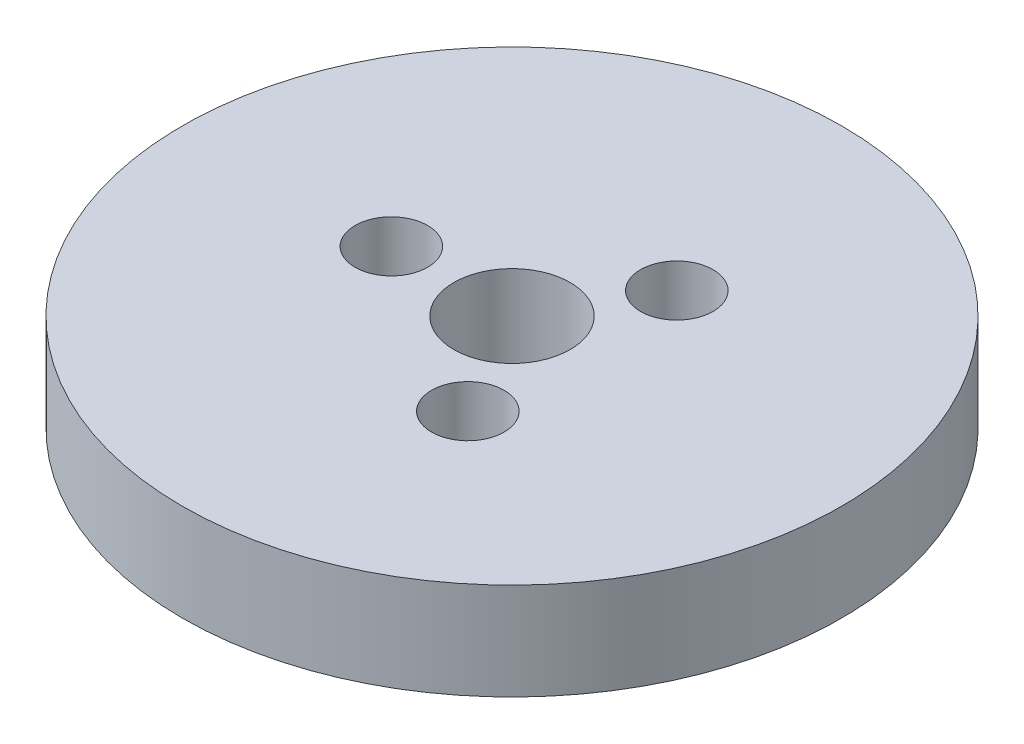
ISO-10303-21;
HEADER;
FILE_DESCRIPTION(('STEP AP214'),'2;1');
FILE_NAME('part.step','',(''),(''),'','','');
FILE_SCHEMA(('AUTOMOTIVE_DESIGN { 1 0 10303 214 1 1 1 1 }'));
ENDSEC;
DATA;
#1=APPLICATION_CONTEXT('core data for automotive mechanical design processes');
#2=APPLICATION_PROTOCOL_DEFINITION('international standard','automotive_design',2000,#1);
#3=PRODUCT_CONTEXT('',#1,'mechanical');
#4=PRODUCT('Part','Part','',(#3));
#5=PRODUCT_RELATED_PRODUCT_CATEGORY('part','',(#4));
#6=PRODUCT_DEFINITION_FORMATION('','',#4);
#7=PRODUCT_DEFINITION_CONTEXT('part definition',#1,'design');
#8=PRODUCT_DEFINITION('design','',#6,#7);
#9=PRODUCT_DEFINITION_SHAPE('','',#8);
#10=(LENGTH_UNIT() NAMED_UNIT(*) SI_UNIT(.MILLI.,.METRE.));
#11=(NAMED_UNIT(*) PLANE_ANGLE_UNIT() SI_UNIT($,.RADIAN.));
#12=(NAMED_UNIT(*) SI_UNIT($,.STERADIAN.) SOLID_ANGLE_UNIT());
#13=UNCERTAINTY_MEASURE_WITH_UNIT(LENGTH_MEASURE(1.E-05),#10,'distance_accuracy_value','');
#14=(GEOMETRIC_REPRESENTATION_CONTEXT(3) GLOBAL_UNCERTAINTY_ASSIGNED_CONTEXT((#13)) GLOBAL_UNIT_ASSIGNED_CONTEXT((#10,
#11,#12)) REPRESENTATION_CONTEXT('',''));
#15=CARTESIAN_POINT('',(0.,0.,0.));
#16=DIRECTION('',(0.,0.,1.));
#17=DIRECTION('',(1.,0.,0.));
#18=AXIS2_PLACEMENT_3D('',#15,#16,#17);
#19=CARTESIAN_POINT('',(0.,25.,0.));
#20=DIRECTION('',(0.,-1.,0.));
#21=DIRECTION('',(0.,0.,-1.));
#22=AXIS2_PLACEMENT_3D('',#19,#20,#21);
#23=CYLINDRICAL_SURFACE('',#22,85.);
#24=CARTESIAN_POINT('',(0.,25.,0.));
#25=DIRECTION('',(0.,1.,0.));
#26=DIRECTION('',(0.,0.,1.));
#27=AXIS2_PLACEMENT_3D('',#24,#25,#26);
#28=CIRCLE('',#27,85.);
#29=CARTESIAN_POINT('',(0.,25.,85.));
#30=VERTEX_POINT('',#29);
#31=EDGE_CURVE('E10',#30,#30,#28,.T.);
#32=ORIENTED_EDGE('',*,*,#31,.F.);
#33=EDGE_LOOP('',(#32));
#34=FACE_BOUND('',#33,.T.);
#35=CARTESIAN_POINT('',(0.,0.,0.));
#36=DIRECTION('',(0.,1.,0.));
#37=DIRECTION('',(0.,0.,1.));
#38=AXIS2_PLACEMENT_3D('',#35,#36,#37);
#39=CIRCLE('',#38,85.);
#40=CARTESIAN_POINT('',(0.,0.,85.));
#41=VERTEX_POINT('',#40);
#42=EDGE_CURVE('E37',#41,#41,#39,.T.);
#43=ORIENTED_EDGE('',*,*,#42,.T.);
#44=EDGE_LOOP('',(#43));
#45=FACE_BOUND('',#44,.T.);
#46=ADVANCED_FACE('F40',(#34,#45),#23,.T.);
#47=CARTESIAN_POINT('',(0.,25.,0.));
#48=DIRECTION('',(0.,1.,0.));
#49=DIRECTION('',(0.,0.,1.));
#50=AXIS2_PLACEMENT_3D('',#47,#48,#49);
#51=PLANE('',#50);
#52=CARTESIAN_POINT('',(15.5590153157143,25.,26.9490050425592));
#53=DIRECTION('',(0.,1.,0.));
#54=DIRECTION('',(0.866025403784436,0.,-0.500000000000004));
#55=AXIS2_PLACEMENT_3D('',#52,#53,#54);
#56=CIRCLE('',#55,9.35262577643471);
#57=CARTESIAN_POINT('',(23.6586268301959,25.,22.2726921543418));
#58=VERTEX_POINT('',#57);
#59=EDGE_CURVE('E70',#58,#58,#56,.T.);
#60=ORIENTED_EDGE('',*,*,#59,.F.);
#61=EDGE_LOOP('',(#60));
#62=FACE_BOUND('',#61,.T.);
#63=CARTESIAN_POINT('',(15.5590153157139,25.,-26.9490050425594));
#64=DIRECTION('',(0.,1.,0.));
#65=DIRECTION('',(-0.866025403784443,0.,-0.499999999999992));
#66=AXIS2_PLACEMENT_3D('',#63,#64,#65);
#67=CIRCLE('',#66,9.35262577643471);
#68=CARTESIAN_POINT('',(7.45940380123228,25.,-31.6253179307767));
#69=VERTEX_POINT('',#68);
#70=EDGE_CURVE('E61',#69,#69,#67,.T.);
#71=ORIENTED_EDGE('',*,*,#70,.F.);
#72=EDGE_LOOP('',(#71));
#73=FACE_BOUND('',#72,.T.);
#74=CARTESIAN_POINT('',(-31.1180306314284,25.,0.));
#75=DIRECTION('',(0.,1.,0.));
#76=DIRECTION('',(0.,0.,1.));
#77=AXIS2_PLACEMENT_3D('',#74,#75,#76);
#78=CIRCLE('',#77,9.35262577643471);
#79=CARTESIAN_POINT('',(-31.1180306314284,25.,9.35262577643471));
#80=VERTEX_POINT('',#79);
#81=EDGE_CURVE('E54',#80,#80,#78,.T.);
#82=ORIENTED_EDGE('',*,*,#81,.F.);
#83=EDGE_LOOP('',(#82));
#84=FACE_BOUND('',#83,.T.);
#85=CARTESIAN_POINT('',(0.,25.,0.));
#86=DIRECTION('',(0.,1.,0.));
#87=DIRECTION('',(0.,0.,1.));
#88=AXIS2_PLACEMENT_3D('',#85,#86,#87);
#89=CIRCLE('',#88,15.);
#90=CARTESIAN_POINT('',(0.,25.,15.));
#91=VERTEX_POINT('',#90);
#92=EDGE_CURVE('E50',#91,#91,#89,.T.);
#93=ORIENTED_EDGE('',*,*,#92,.F.);
#94=EDGE_LOOP('',(#93));
#95=FACE_BOUND('',#94,.T.);
#96=ORIENTED_EDGE('',*,*,#31,.T.);
#97=EDGE_LOOP('',(#96));
#98=FACE_BOUND('',#97,.T.);
#99=ADVANCED_FACE('F85',(#62,#73,#84,#95,#98),#51,.T.);
#100=CARTESIAN_POINT('',(0.,0.,0.));
#101=DIRECTION('',(0.,1.,0.));
#102=DIRECTION('',(0.,0.,1.));
#103=AXIS2_PLACEMENT_3D('',#100,#101,#102);
#104=PLANE('',#103);
#105=CARTESIAN_POINT('',(0.,0.,0.));
#106=DIRECTION('',(0.,1.,0.));
#107=DIRECTION('',(0.,0.,1.));
#108=AXIS2_PLACEMENT_3D('',#105,#106,#107);
#109=CIRCLE('',#108,15.);
#110=CARTESIAN_POINT('',(0.,0.,15.));
#111=VERTEX_POINT('',#110);
#112=EDGE_CURVE('E47',#111,#111,#109,.T.);
#113=ORIENTED_EDGE('',*,*,#112,.T.);
#114=EDGE_LOOP('',(#113));
#115=FACE_BOUND('',#114,.T.);
#116=ORIENTED_EDGE('',*,*,#42,.F.);
#117=EDGE_LOOP('',(#116));
#118=FACE_BOUND('',#117,.T.);
#119=ADVANCED_FACE('F84',(#115,#118),#104,.F.);
#120=CARTESIAN_POINT('',(0.,25.,0.));
#121=DIRECTION('',(0.,-1.,0.));
#122=DIRECTION('',(0.,0.,-1.));
#123=AXIS2_PLACEMENT_3D('',#120,#121,#122);
#124=CYLINDRICAL_SURFACE('',#123,15.);
#125=ORIENTED_EDGE('',*,*,#92,.T.);
#126=EDGE_LOOP('',(#125));
#127=FACE_BOUND('',#126,.T.);
#128=ORIENTED_EDGE('',*,*,#112,.F.);
#129=EDGE_LOOP('',(#128));
#130=FACE_BOUND('',#129,.T.);
#131=ADVANCED_FACE('F91',(#127,#130),#124,.F.);
#132=CARTESIAN_POINT('',(-31.1180306314284,7.42842494550896,0.));
#133=DIRECTION('',(0.,1.,0.));
#134=DIRECTION('',(0.,0.,1.));
#135=AXIS2_PLACEMENT_3D('',#132,#133,#134);
#136=CYLINDRICAL_SURFACE('',#135,9.35262577643471);
#137=CARTESIAN_POINT('',(-31.1180306314284,7.42842494550896,0.));
#138=DIRECTION('',(0.,1.,0.));
#139=DIRECTION('',(0.,0.,1.));
#140=AXIS2_PLACEMENT_3D('',#137,#138,#139);
#141=CIRCLE('',#140,9.35262577643471);
#142=CARTESIAN_POINT('',(-31.1180306314284,7.42842494550896,9.35262577643471));
#143=VERTEX_POINT('',#142);
#144=EDGE_CURVE('E55',#143,#143,#141,.T.);
#145=ORIENTED_EDGE('',*,*,#144,.F.);
#146=EDGE_LOOP('',(#145));
#147=FACE_BOUND('',#146,.T.);
#148=ORIENTED_EDGE('',*,*,#81,.T.);
#149=EDGE_LOOP('',(#148));
#150=FACE_BOUND('',#149,.T.);
#151=ADVANCED_FACE('F96',(#147,#150),#136,.F.);
#152=CARTESIAN_POINT('',(-31.1180306314284,7.42842494550896,0.));
#153=DIRECTION('',(0.,1.,0.));
#154=DIRECTION('',(0.,0.,1.));
#155=AXIS2_PLACEMENT_3D('',#152,#153,#154);
#156=PLANE('',#155);
#157=ORIENTED_EDGE('',*,*,#144,.T.);
#158=EDGE_LOOP('',(#157));
#159=FACE_BOUND('',#158,.T.);
#160=ADVANCED_FACE('F127',(#159),#156,.T.);
#161=CARTESIAN_POINT('',(15.5590153157139,7.42842494550896,-26.9490050425594));
#162=DIRECTION('',(0.,1.,0.));
#163=DIRECTION('',(0.,0.,1.));
#164=AXIS2_PLACEMENT_3D('',#161,#162,#163);
#165=CYLINDRICAL_SURFACE('',#164,9.35262577643471);
#166=CARTESIAN_POINT('',(15.5590153157139,7.42842494550896,-26.9490050425594));
#167=DIRECTION('',(0.,1.,0.));
#168=DIRECTION('',(-0.866025403784443,0.,-0.499999999999992));
#169=AXIS2_PLACEMENT_3D('',#166,#167,#168);
#170=CIRCLE('',#169,9.35262577643471);
#171=CARTESIAN_POINT('',(7.45940380123228,7.42842494550896,-31.6253179307767));
#172=VERTEX_POINT('',#171);
#173=EDGE_CURVE('E63',#172,#172,#170,.T.);
#174=ORIENTED_EDGE('',*,*,#173,.F.);
#175=EDGE_LOOP('',(#174));
#176=FACE_BOUND('',#175,.T.);
#177=ORIENTED_EDGE('',*,*,#70,.T.);
#178=EDGE_LOOP('',(#177));
#179=FACE_BOUND('',#178,.T.);
#180=ADVANCED_FACE('F133',(#176,#179),#165,.F.);
#181=CARTESIAN_POINT('',(15.5590153157139,7.42842494550896,-26.9490050425594));
#182=DIRECTION('',(0.,1.,0.));
#183=DIRECTION('',(-0.866025403784443,0.,-0.499999999999992));
#184=AXIS2_PLACEMENT_3D('',#181,#182,#183);
#185=PLANE('',#184);
#186=ORIENTED_EDGE('',*,*,#173,.T.);
#187=EDGE_LOOP('',(#186));
#188=FACE_BOUND('',#187,.T.);
#189=ADVANCED_FACE('F77',(#188),#185,.T.);
#190=CARTESIAN_POINT('',(15.5590153157143,7.42842494550896,26.9490050425592));
#191=DIRECTION('',(0.,1.,0.));
#192=DIRECTION('',(0.,0.,1.));
#193=AXIS2_PLACEMENT_3D('',#190,#191,#192);
#194=CYLINDRICAL_SURFACE('',#193,9.35262577643471);
#195=CARTESIAN_POINT('',(15.5590153157143,7.42842494550896,26.9490050425592));
#196=DIRECTION('',(0.,1.,0.));
#197=DIRECTION('',(0.866025403784436,0.,-0.500000000000004));
#198=AXIS2_PLACEMENT_3D('',#195,#196,#197);
#199=CIRCLE('',#198,9.35262577643471);
#200=CARTESIAN_POINT('',(23.6586268301959,7.42842494550896,22.2726921543418));
#201=VERTEX_POINT('',#200);
#202=EDGE_CURVE('E59',#201,#201,#199,.T.);
#203=ORIENTED_EDGE('',*,*,#202,.F.);
#204=EDGE_LOOP('',(#203));
#205=FACE_BOUND('',#204,.T.);
#206=ORIENTED_EDGE('',*,*,#59,.T.);
#207=EDGE_LOOP('',(#206));
#208=FACE_BOUND('',#207,.T.);
#209=ADVANCED_FACE('F73',(#205,#208),#194,.F.);
#210=CARTESIAN_POINT('',(15.5590153157143,7.42842494550896,26.9490050425592));
#211=DIRECTION('',(0.,1.,0.));
#212=DIRECTION('',(0.866025403784436,0.,-0.500000000000004));
#213=AXIS2_PLACEMENT_3D('',#210,#211,#212);
#214=PLANE('',#213);
#215=ORIENTED_EDGE('',*,*,#202,.T.);
#216=EDGE_LOOP('',(#215));
#217=FACE_BOUND('',#216,.T.);
#218=ADVANCED_FACE('F71',(#217),#214,.T.);
#219=CLOSED_SHELL('',(#46,#99,#119,#131,#151,#160,#180,#189,#209,#218));
#220=MANIFOLD_SOLID_BREP('B2',#219);
#221=ADVANCED_BREP_SHAPE_REPRESENTATION('',(#18,#220),#14);
#222=SHAPE_DEFINITION_REPRESENTATION(#9,#221);
ENDSEC;
END-ISO-10303-21;
